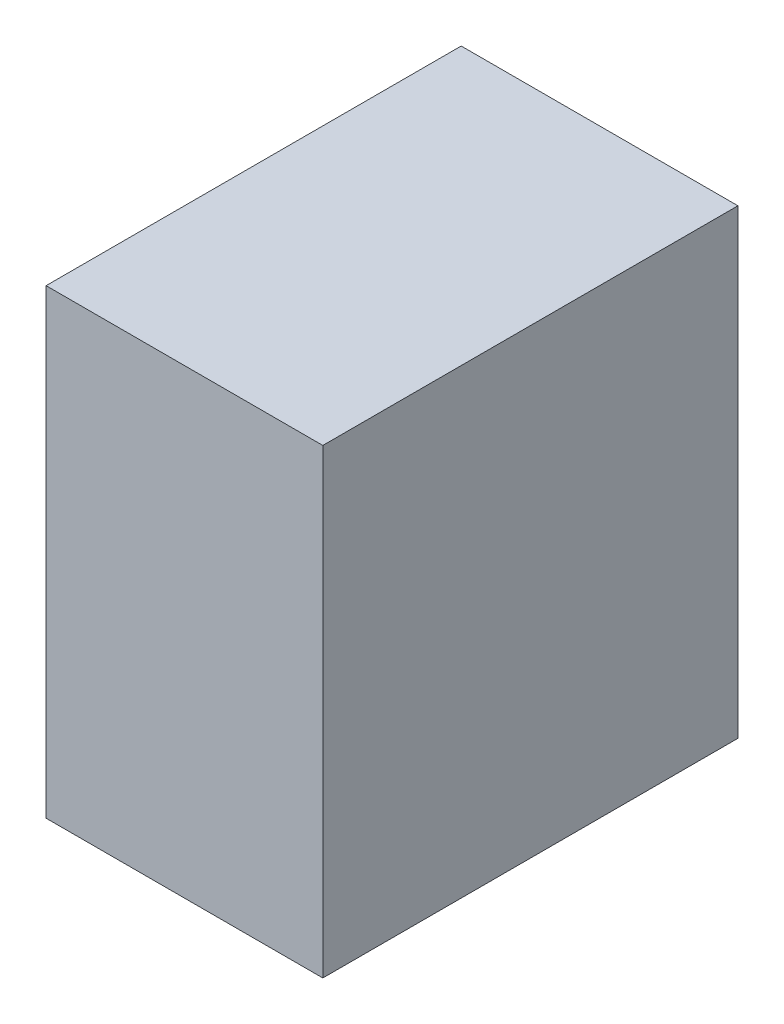
ISO-10303-21;
HEADER;
FILE_DESCRIPTION(('STEP AP214'),'2;1');
FILE_NAME('part.step','',(''),(''),'','','');
FILE_SCHEMA(('AUTOMOTIVE_DESIGN { 1 0 10303 214 1 1 1 1 }'));
ENDSEC;
DATA;
#1=APPLICATION_CONTEXT('core data for automotive mechanical design processes');
#2=APPLICATION_PROTOCOL_DEFINITION('international standard','automotive_design',2000,#1);
#3=PRODUCT_CONTEXT('',#1,'mechanical');
#4=PRODUCT('Part','Part','',(#3));
#5=PRODUCT_RELATED_PRODUCT_CATEGORY('part','',(#4));
#6=PRODUCT_DEFINITION_FORMATION('','',#4);
#7=PRODUCT_DEFINITION_CONTEXT('part definition',#1,'design');
#8=PRODUCT_DEFINITION('design','',#6,#7);
#9=PRODUCT_DEFINITION_SHAPE('','',#8);
#10=(LENGTH_UNIT() NAMED_UNIT(*) SI_UNIT(.MILLI.,.METRE.));
#11=(NAMED_UNIT(*) PLANE_ANGLE_UNIT() SI_UNIT($,.RADIAN.));
#12=(NAMED_UNIT(*) SI_UNIT($,.STERADIAN.) SOLID_ANGLE_UNIT());
#13=UNCERTAINTY_MEASURE_WITH_UNIT(LENGTH_MEASURE(1.E-05),#10,'distance_accuracy_value','');
#14=(GEOMETRIC_REPRESENTATION_CONTEXT(3) GLOBAL_UNCERTAINTY_ASSIGNED_CONTEXT((#13)) GLOBAL_UNIT_ASSIGNED_CONTEXT((#10,
#11,#12)) REPRESENTATION_CONTEXT('',''));
#15=CARTESIAN_POINT('',(0.,0.,0.));
#16=DIRECTION('',(0.,0.,1.));
#17=DIRECTION('',(1.,0.,0.));
#18=AXIS2_PLACEMENT_3D('',#15,#16,#17);
#19=CARTESIAN_POINT('',(3.30000012239191,0.699999637193477,-3.30112158219201));
#20=DIRECTION('',(1.,-1.74845553146952E-07,0.));
#21=DIRECTION('',(1.74845553146952E-07,1.,-8.74227765734759E-08));
#22=AXIS2_PLACEMENT_3D('',#19,#20,#21);
#23=PLANE('',#22);
#24=DIRECTION('',(-1.74845553146599E-07,-0.999999999999981,8.74227765732993E-08));
#25=VECTOR('',#24,1.);
#26=CARTESIAN_POINT('',(3.30000030597974,1.74999972024712,-2.35112167398593));
#27=LINE('',#26,#25);
#28=CARTESIAN_POINT('',(3.30000030598074,1.74999972024612,-2.35112167398593));
#29=VERTEX_POINT('',#28);
#30=CARTESIAN_POINT('',(3.30000013113519,0.749999720245115,-2.35112158656415));
#31=VERTEX_POINT('',#30);
#32=EDGE_CURVE('E11',#29,#31,#27,.T.);
#33=ORIENTED_EDGE('',*,*,#32,.F.);
#34=DIRECTION('',(0.,8.74227766721621E-08,0.999999999999996));
#35=VECTOR('',#34,1.);
#36=CARTESIAN_POINT('',(3.30000030597974,1.74999964156662,-3.25112167398593));
#37=LINE('',#36,#35);
#38=CARTESIAN_POINT('',(3.30000030598074,1.74999964156662,-3.25112167398493));
#39=VERTEX_POINT('',#38);
#40=EDGE_CURVE('E59',#39,#29,#37,.T.);
#41=ORIENTED_EDGE('',*,*,#40,.F.);
#42=DIRECTION('',(1.74845553146599E-07,0.999999999999981,-8.74227765732994E-08));
#43=VECTOR('',#42,1.);
#44=CARTESIAN_POINT('',(3.30000013113418,0.749999641564616,-3.25112158656315));
#45=LINE('',#44,#43);
#46=CARTESIAN_POINT('',(3.30000013113518,0.749999641565616,-3.25112158656315));
#47=VERTEX_POINT('',#46);
#48=EDGE_CURVE('E79',#47,#39,#45,.T.);
#49=ORIENTED_EDGE('',*,*,#48,.F.);
#50=DIRECTION('',(0.,-8.7422776548804E-08,-0.999999999999996));
#51=VECTOR('',#50,1.);
#52=CARTESIAN_POINT('',(3.30000013113419,0.749999720245115,-2.35112158656315));
#53=LINE('',#52,#51);
#54=EDGE_CURVE('E84',#31,#47,#53,.T.);
#55=ORIENTED_EDGE('',*,*,#54,.F.);
#56=EDGE_LOOP('',(#33,#41,#49,#55));
#57=FACE_BOUND('',#56,.T.);
#58=ADVANCED_FACE('F17',(#57),#23,.F.);
#59=CARTESIAN_POINT('',(3.90000012239191,0.699999532286145,-3.30112158219201));
#60=DIRECTION('',(1.,-1.74845553146952E-07,0.));
#61=DIRECTION('',(1.74845553146952E-07,1.,-8.74227765734759E-08));
#62=AXIS2_PLACEMENT_3D('',#59,#60,#61);
#63=PLANE('',#62);
#64=DIRECTION('',(0.,-8.7422776672162E-08,-0.999999999999996));
#65=VECTOR('',#64,1.);
#66=CARTESIAN_POINT('',(3.90000013113419,0.749999615337783,-2.35112158656315));
#67=LINE('',#66,#65);
#68=CARTESIAN_POINT('',(3.90000013113319,0.749999615337783,-2.35112158656415));
#69=VERTEX_POINT('',#68);
#70=CARTESIAN_POINT('',(3.90000013113318,0.749999536658284,-3.25112158656315));
#71=VERTEX_POINT('',#70);
#72=EDGE_CURVE('E24',#69,#71,#67,.T.);
#73=ORIENTED_EDGE('',*,*,#72,.T.);
#74=DIRECTION('',(1.74845553146599E-07,0.999999999999981,-8.74227765732993E-08));
#75=VECTOR('',#74,1.);
#76=CARTESIAN_POINT('',(3.90000013113418,0.749999536657284,-3.25112158656315));
#77=LINE('',#76,#75);
#78=CARTESIAN_POINT('',(3.90000030597874,1.74999953665928,-3.25112167398492));
#79=VERTEX_POINT('',#78);
#80=EDGE_CURVE('E82',#71,#79,#77,.T.);
#81=ORIENTED_EDGE('',*,*,#80,.T.);
#82=DIRECTION('',(0.,8.7422776672162E-08,0.999999999999996));
#83=VECTOR('',#82,1.);
#84=CARTESIAN_POINT('',(3.90000030597974,1.74999953665928,-3.25112167398592));
#85=LINE('',#84,#83);
#86=CARTESIAN_POINT('',(3.90000030597874,1.74999961533878,-2.35112167398592));
#87=VERTEX_POINT('',#86);
#88=EDGE_CURVE('E64',#79,#87,#85,.T.);
#89=ORIENTED_EDGE('',*,*,#88,.T.);
#90=DIRECTION('',(-1.74845553146599E-07,-0.999999999999981,8.74227765732993E-08));
#91=VECTOR('',#90,1.);
#92=CARTESIAN_POINT('',(3.90000030597974,1.74999961533978,-2.35112167398592));
#93=LINE('',#92,#91);
#94=EDGE_CURVE('E61',#87,#69,#93,.T.);
#95=ORIENTED_EDGE('',*,*,#94,.T.);
#96=EDGE_LOOP('',(#73,#81,#89,#95));
#97=FACE_BOUND('',#96,.T.);
#98=ADVANCED_FACE('F62',(#97),#63,.T.);
#99=CARTESIAN_POINT('',(3.30000013113419,0.749999720245115,-2.35112158656315));
#100=DIRECTION('',(-1.74845553146952E-07,-1.,8.74227765734759E-08));
#101=DIRECTION('',(0.,-8.74227765734759E-08,-1.));
#102=AXIS2_PLACEMENT_3D('',#99,#100,#101);
#103=PLANE('',#102);
#104=ORIENTED_EDGE('',*,*,#54,.T.);
#105=DIRECTION('',(0.999999999999985,-1.74845553220964E-07,0.));
#106=VECTOR('',#105,1.);
#107=CARTESIAN_POINT('',(3.30000013113418,0.749999641564616,-3.25112158656315));
#108=LINE('',#107,#106);
#109=EDGE_CURVE('E57',#47,#71,#108,.T.);
#110=ORIENTED_EDGE('',*,*,#109,.T.);
#111=ORIENTED_EDGE('',*,*,#72,.F.);
#112=DIRECTION('',(0.999999999999985,-1.74845553220964E-07,0.));
#113=VECTOR('',#112,1.);
#114=CARTESIAN_POINT('',(3.30000013113419,0.749999720245115,-2.35112158656315));
#115=LINE('',#114,#113);
#116=EDGE_CURVE('E55',#31,#69,#115,.T.);
#117=ORIENTED_EDGE('',*,*,#116,.F.);
#118=EDGE_LOOP('',(#104,#110,#111,#117));
#119=FACE_BOUND('',#118,.T.);
#120=ADVANCED_FACE('F53',(#119),#103,.T.);
#121=CARTESIAN_POINT('',(3.30000013113418,0.749999641564616,-3.25112158656315));
#122=DIRECTION('',(0.,-8.74227765734759E-08,-1.));
#123=DIRECTION('',(1.74845553146952E-07,1.,-8.74227765734759E-08));
#124=AXIS2_PLACEMENT_3D('',#121,#122,#123);
#125=PLANE('',#124);
#126=ORIENTED_EDGE('',*,*,#48,.T.);
#127=DIRECTION('',(0.999999999999985,-1.74845553220964E-07,0.));
#128=VECTOR('',#127,1.);
#129=CARTESIAN_POINT('',(3.30000030597974,1.74999964156662,-3.25112167398593));
#130=LINE('',#129,#128);
#131=EDGE_CURVE('E68',#39,#79,#130,.T.);
#132=ORIENTED_EDGE('',*,*,#131,.T.);
#133=ORIENTED_EDGE('',*,*,#80,.F.);
#134=ORIENTED_EDGE('',*,*,#109,.F.);
#135=EDGE_LOOP('',(#126,#132,#133,#134));
#136=FACE_BOUND('',#135,.T.);
#137=ADVANCED_FACE('F91',(#136),#125,.T.);
#138=CARTESIAN_POINT('',(3.30000030597974,1.74999964156662,-3.25112167398593));
#139=DIRECTION('',(1.74845553146952E-07,1.,-8.74227765734759E-08));
#140=DIRECTION('',(0.,8.74227765734759E-08,1.));
#141=AXIS2_PLACEMENT_3D('',#138,#139,#140);
#142=PLANE('',#141);
#143=ORIENTED_EDGE('',*,*,#40,.T.);
#144=DIRECTION('',(0.999999999999985,-1.74845553220964E-07,0.));
#145=VECTOR('',#144,1.);
#146=CARTESIAN_POINT('',(3.30000030597974,1.74999972024712,-2.35112167398593));
#147=LINE('',#146,#145);
#148=EDGE_CURVE('E69',#29,#87,#147,.T.);
#149=ORIENTED_EDGE('',*,*,#148,.T.);
#150=ORIENTED_EDGE('',*,*,#88,.F.);
#151=ORIENTED_EDGE('',*,*,#131,.F.);
#152=EDGE_LOOP('',(#143,#149,#150,#151));
#153=FACE_BOUND('',#152,.T.);
#154=ADVANCED_FACE('F88',(#153),#142,.T.);
#155=CARTESIAN_POINT('',(3.30000030597974,1.74999972024712,-2.35112167398593));
#156=DIRECTION('',(0.,8.74227765734759E-08,1.));
#157=DIRECTION('',(-1.74845553146952E-07,-1.,8.74227765734759E-08));
#158=AXIS2_PLACEMENT_3D('',#155,#156,#157);
#159=PLANE('',#158);
#160=ORIENTED_EDGE('',*,*,#32,.T.);
#161=ORIENTED_EDGE('',*,*,#116,.T.);
#162=ORIENTED_EDGE('',*,*,#94,.F.);
#163=ORIENTED_EDGE('',*,*,#148,.F.);
#164=EDGE_LOOP('',(#160,#161,#162,#163));
#165=FACE_BOUND('',#164,.T.);
#166=ADVANCED_FACE('F71',(#165),#159,.T.);
#167=CLOSED_SHELL('',(#58,#98,#120,#137,#154,#166));
#168=MANIFOLD_SOLID_BREP('B1',#167);
#169=ADVANCED_BREP_SHAPE_REPRESENTATION('',(#18,#168),#14);
#170=SHAPE_DEFINITION_REPRESENTATION(#9,#169);
ENDSEC;
END-ISO-10303-21;
